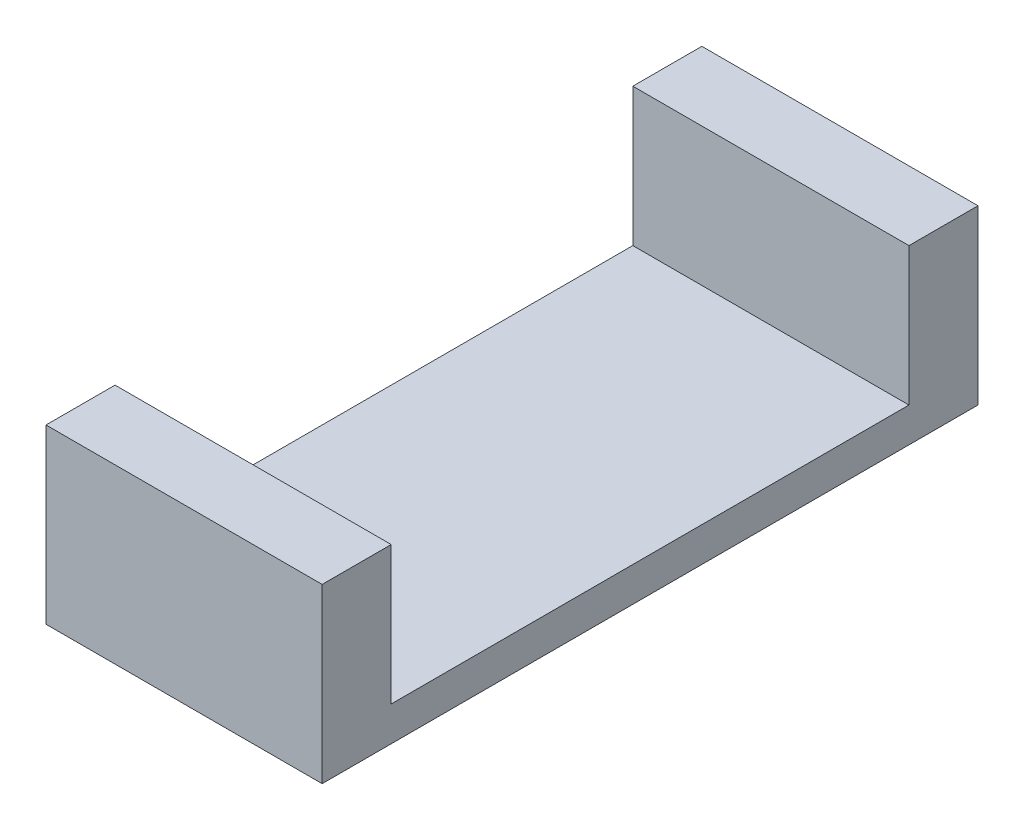
ISO-10303-21;
HEADER;
FILE_DESCRIPTION(('STEP AP214'),'2;1');
FILE_NAME('part.step','',(''),(''),'','','');
FILE_SCHEMA(('AUTOMOTIVE_DESIGN { 1 0 10303 214 1 1 1 1 }'));
ENDSEC;
DATA;
#1=APPLICATION_CONTEXT('core data for automotive mechanical design processes');
#2=APPLICATION_PROTOCOL_DEFINITION('international standard','automotive_design',2000,#1);
#3=PRODUCT_CONTEXT('',#1,'mechanical');
#4=PRODUCT('Part','Part','',(#3));
#5=PRODUCT_RELATED_PRODUCT_CATEGORY('part','',(#4));
#6=PRODUCT_DEFINITION_FORMATION('','',#4);
#7=PRODUCT_DEFINITION_CONTEXT('part definition',#1,'design');
#8=PRODUCT_DEFINITION('design','',#6,#7);
#9=PRODUCT_DEFINITION_SHAPE('','',#8);
#10=(LENGTH_UNIT() NAMED_UNIT(*) SI_UNIT(.MILLI.,.METRE.));
#11=(NAMED_UNIT(*) PLANE_ANGLE_UNIT() SI_UNIT($,.RADIAN.));
#12=(NAMED_UNIT(*) SI_UNIT($,.STERADIAN.) SOLID_ANGLE_UNIT());
#13=UNCERTAINTY_MEASURE_WITH_UNIT(LENGTH_MEASURE(1.E-05),#10,'distance_accuracy_value','');
#14=(GEOMETRIC_REPRESENTATION_CONTEXT(3) GLOBAL_UNCERTAINTY_ASSIGNED_CONTEXT((#13)) GLOBAL_UNIT_ASSIGNED_CONTEXT((#10,
#11,#12)) REPRESENTATION_CONTEXT('',''));
#15=CARTESIAN_POINT('',(0.,0.,0.));
#16=DIRECTION('',(0.,0.,1.));
#17=DIRECTION('',(1.,0.,0.));
#18=AXIS2_PLACEMENT_3D('',#15,#16,#17);
#19=CARTESIAN_POINT('',(18.5,2.02,14.33));
#20=DIRECTION('',(0.,0.,-1.));
#21=DIRECTION('',(-1.,0.,0.));
#22=AXIS2_PLACEMENT_3D('',#19,#20,#21);
#23=PLANE('',#22);
#24=DIRECTION('',(0.,1.,0.));
#25=VECTOR('',#24,1.);
#26=CARTESIAN_POINT('',(18.5,1.52,14.33));
#27=LINE('',#26,#25);
#28=CARTESIAN_POINT('',(18.5,1.62,14.33));
#29=VERTEX_POINT('',#28);
#30=CARTESIAN_POINT('',(18.5,2.02,14.33));
#31=VERTEX_POINT('',#30);
#32=EDGE_CURVE('E97',#29,#31,#27,.T.);
#33=ORIENTED_EDGE('',*,*,#32,.F.);
#34=DIRECTION('',(1.,0.,0.));
#35=VECTOR('',#34,1.);
#36=CARTESIAN_POINT('',(18.9,1.62,14.33));
#37=LINE('',#36,#35);
#38=CARTESIAN_POINT('',(19.3,1.62,14.33));
#39=VERTEX_POINT('',#38);
#40=EDGE_CURVE('E96',#29,#39,#37,.T.);
#41=ORIENTED_EDGE('',*,*,#40,.T.);
#42=DIRECTION('',(0.,1.,0.));
#43=VECTOR('',#42,1.);
#44=CARTESIAN_POINT('',(19.3,1.52,14.33));
#45=LINE('',#44,#43);
#46=CARTESIAN_POINT('',(19.3,2.02,14.33));
#47=VERTEX_POINT('',#46);
#48=EDGE_CURVE('E84',#47,#39,#45,.F.);
#49=ORIENTED_EDGE('',*,*,#48,.F.);
#50=DIRECTION('',(1.,0.,0.));
#51=VECTOR('',#50,1.);
#52=CARTESIAN_POINT('',(18.9,2.02,14.33));
#53=LINE('',#52,#51);
#54=EDGE_CURVE('E20',#31,#47,#53,.T.);
#55=ORIENTED_EDGE('',*,*,#54,.F.);
#56=EDGE_LOOP('',(#33,#41,#49,#55));
#57=FACE_BOUND('',#56,.T.);
#58=ADVANCED_FACE('F17',(#57),#23,.F.);
#59=CARTESIAN_POINT('',(18.9,2.02,15.08));
#60=DIRECTION('',(0.,1.,0.));
#61=DIRECTION('',(0.,0.,1.));
#62=AXIS2_PLACEMENT_3D('',#59,#60,#61);
#63=PLANE('',#62);
#64=DIRECTION('',(-1.,0.,0.));
#65=VECTOR('',#64,1.);
#66=CARTESIAN_POINT('',(19.3,2.02,14.13));
#67=LINE('',#66,#65);
#68=CARTESIAN_POINT('',(18.5,2.02,14.13));
#69=VERTEX_POINT('',#68);
#70=CARTESIAN_POINT('',(19.3,2.02,14.13));
#71=VERTEX_POINT('',#70);
#72=EDGE_CURVE('E136',#69,#71,#67,.F.);
#73=ORIENTED_EDGE('',*,*,#72,.F.);
#74=DIRECTION('',(0.,0.,1.));
#75=VECTOR('',#74,1.);
#76=CARTESIAN_POINT('',(18.5,2.02,14.13));
#77=LINE('',#76,#75);
#78=EDGE_CURVE('E131',#31,#69,#77,.F.);
#79=ORIENTED_EDGE('',*,*,#78,.F.);
#80=ORIENTED_EDGE('',*,*,#54,.T.);
#81=DIRECTION('',(0.,0.,-1.));
#82=VECTOR('',#81,1.);
#83=CARTESIAN_POINT('',(19.3,2.02,16.03));
#84=LINE('',#83,#82);
#85=EDGE_CURVE('E91',#71,#47,#84,.F.);
#86=ORIENTED_EDGE('',*,*,#85,.F.);
#87=EDGE_LOOP('',(#73,#79,#80,#86));
#88=FACE_BOUND('',#87,.T.);
#89=ADVANCED_FACE('F163',(#88),#63,.T.);
#90=CARTESIAN_POINT('',(19.3,2.02,15.83));
#91=DIRECTION('',(0.,0.,1.));
#92=DIRECTION('',(1.,0.,0.));
#93=AXIS2_PLACEMENT_3D('',#90,#91,#92);
#94=PLANE('',#93);
#95=DIRECTION('',(0.,1.,0.));
#96=VECTOR('',#95,1.);
#97=CARTESIAN_POINT('',(19.3,1.52,15.83));
#98=LINE('',#97,#96);
#99=CARTESIAN_POINT('',(19.3,1.62,15.83));
#100=VERTEX_POINT('',#99);
#101=CARTESIAN_POINT('',(19.3,2.02,15.83));
#102=VERTEX_POINT('',#101);
#103=EDGE_CURVE('E105',#100,#102,#98,.T.);
#104=ORIENTED_EDGE('',*,*,#103,.F.);
#105=DIRECTION('',(1.,0.,0.));
#106=VECTOR('',#105,1.);
#107=CARTESIAN_POINT('',(18.9,1.62,15.83));
#108=LINE('',#107,#106);
#109=CARTESIAN_POINT('',(18.5,1.62,15.83));
#110=VERTEX_POINT('',#109);
#111=EDGE_CURVE('E101',#100,#110,#108,.F.);
#112=ORIENTED_EDGE('',*,*,#111,.T.);
#113=DIRECTION('',(0.,1.,0.));
#114=VECTOR('',#113,1.);
#115=CARTESIAN_POINT('',(18.5,1.52,15.83));
#116=LINE('',#115,#114);
#117=CARTESIAN_POINT('',(18.5,2.02,15.83));
#118=VERTEX_POINT('',#117);
#119=EDGE_CURVE('E115',#118,#110,#116,.F.);
#120=ORIENTED_EDGE('',*,*,#119,.F.);
#121=DIRECTION('',(1.,0.,0.));
#122=VECTOR('',#121,1.);
#123=CARTESIAN_POINT('',(18.9,2.02,15.83));
#124=LINE('',#123,#122);
#125=EDGE_CURVE('E93',#102,#118,#124,.F.);
#126=ORIENTED_EDGE('',*,*,#125,.F.);
#127=EDGE_LOOP('',(#104,#112,#120,#126));
#128=FACE_BOUND('',#127,.T.);
#129=ADVANCED_FACE('F113',(#128),#94,.F.);
#130=CARTESIAN_POINT('',(18.9,1.62,15.08));
#131=DIRECTION('',(0.,-1.,0.));
#132=DIRECTION('',(0.,0.,-1.));
#133=AXIS2_PLACEMENT_3D('',#130,#131,#132);
#134=PLANE('',#133);
#135=DIRECTION('',(0.,0.,1.));
#136=VECTOR('',#135,1.);
#137=CARTESIAN_POINT('',(18.5,1.62,14.13));
#138=LINE('',#137,#136);
#139=EDGE_CURVE('E116',#110,#29,#138,.F.);
#140=ORIENTED_EDGE('',*,*,#139,.F.);
#141=ORIENTED_EDGE('',*,*,#111,.F.);
#142=DIRECTION('',(0.,0.,-1.));
#143=VECTOR('',#142,1.);
#144=CARTESIAN_POINT('',(19.3,1.62,16.03));
#145=LINE('',#144,#143);
#146=EDGE_CURVE('E89',#39,#100,#145,.F.);
#147=ORIENTED_EDGE('',*,*,#146,.F.);
#148=ORIENTED_EDGE('',*,*,#40,.F.);
#149=EDGE_LOOP('',(#140,#141,#147,#148));
#150=FACE_BOUND('',#149,.T.);
#151=ADVANCED_FACE('F103',(#150),#134,.F.);
#152=CARTESIAN_POINT('',(18.9,2.02,15.08));
#153=DIRECTION('',(0.,1.,0.));
#154=DIRECTION('',(0.,0.,1.));
#155=AXIS2_PLACEMENT_3D('',#152,#153,#154);
#156=PLANE('',#155);
#157=DIRECTION('',(1.,0.,0.));
#158=VECTOR('',#157,1.);
#159=CARTESIAN_POINT('',(18.5,2.02,16.03));
#160=LINE('',#159,#158);
#161=CARTESIAN_POINT('',(19.3,2.02,16.03));
#162=VERTEX_POINT('',#161);
#163=CARTESIAN_POINT('',(18.5,2.02,16.03));
#164=VERTEX_POINT('',#163);
#165=EDGE_CURVE('E121',#162,#164,#160,.F.);
#166=ORIENTED_EDGE('',*,*,#165,.F.);
#167=DIRECTION('',(0.,0.,-1.));
#168=VECTOR('',#167,1.);
#169=CARTESIAN_POINT('',(19.3,2.02,16.03));
#170=LINE('',#169,#168);
#171=EDGE_CURVE('E107',#102,#162,#170,.F.);
#172=ORIENTED_EDGE('',*,*,#171,.F.);
#173=ORIENTED_EDGE('',*,*,#125,.T.);
#174=DIRECTION('',(0.,0.,1.));
#175=VECTOR('',#174,1.);
#176=CARTESIAN_POINT('',(18.5,2.02,14.13));
#177=LINE('',#176,#175);
#178=EDGE_CURVE('E123',#164,#118,#177,.F.);
#179=ORIENTED_EDGE('',*,*,#178,.F.);
#180=EDGE_LOOP('',(#166,#172,#173,#179));
#181=FACE_BOUND('',#180,.T.);
#182=ADVANCED_FACE('F145',(#181),#156,.T.);
#183=CARTESIAN_POINT('',(19.3,1.52,16.03));
#184=DIRECTION('',(1.,0.,0.));
#185=DIRECTION('',(0.,0.,-1.));
#186=AXIS2_PLACEMENT_3D('',#183,#184,#185);
#187=PLANE('',#186);
#188=DIRECTION('',(0.,1.,0.));
#189=VECTOR('',#188,1.);
#190=CARTESIAN_POINT('',(19.3,1.52,14.13));
#191=LINE('',#190,#189);
#192=CARTESIAN_POINT('',(19.3,1.52,14.13));
#193=VERTEX_POINT('',#192);
#194=EDGE_CURVE('E134',#71,#193,#191,.F.);
#195=ORIENTED_EDGE('',*,*,#194,.F.);
#196=ORIENTED_EDGE('',*,*,#85,.T.);
#197=ORIENTED_EDGE('',*,*,#48,.T.);
#198=ORIENTED_EDGE('',*,*,#146,.T.);
#199=ORIENTED_EDGE('',*,*,#103,.T.);
#200=ORIENTED_EDGE('',*,*,#171,.T.);
#201=DIRECTION('',(0.,1.,0.));
#202=VECTOR('',#201,1.);
#203=CARTESIAN_POINT('',(19.3,1.52,16.03));
#204=LINE('',#203,#202);
#205=CARTESIAN_POINT('',(19.3,1.52,16.03));
#206=VERTEX_POINT('',#205);
#207=EDGE_CURVE('E118',#206,#162,#204,.T.);
#208=ORIENTED_EDGE('',*,*,#207,.F.);
#209=DIRECTION('',(0.,0.,1.));
#210=VECTOR('',#209,1.);
#211=CARTESIAN_POINT('',(19.3,1.52,15.08));
#212=LINE('',#211,#210);
#213=EDGE_CURVE('E146',#206,#193,#212,.F.);
#214=ORIENTED_EDGE('',*,*,#213,.T.);
#215=EDGE_LOOP('',(#195,#196,#197,#198,#199,#200,#208,#214));
#216=FACE_BOUND('',#215,.T.);
#217=ADVANCED_FACE('F87',(#216),#187,.T.);
#218=CARTESIAN_POINT('',(19.3,1.52,14.13));
#219=DIRECTION('',(0.,0.,-1.));
#220=DIRECTION('',(-1.,0.,0.));
#221=AXIS2_PLACEMENT_3D('',#218,#219,#220);
#222=PLANE('',#221);
#223=ORIENTED_EDGE('',*,*,#72,.T.);
#224=ORIENTED_EDGE('',*,*,#194,.T.);
#225=DIRECTION('',(1.,0.,0.));
#226=VECTOR('',#225,1.);
#227=CARTESIAN_POINT('',(18.9,1.52,14.13));
#228=LINE('',#227,#226);
#229=CARTESIAN_POINT('',(18.5,1.52,14.13));
#230=VERTEX_POINT('',#229);
#231=EDGE_CURVE('E150',#193,#230,#228,.F.);
#232=ORIENTED_EDGE('',*,*,#231,.T.);
#233=DIRECTION('',(0.,1.,0.));
#234=VECTOR('',#233,1.);
#235=CARTESIAN_POINT('',(18.5,1.52,14.13));
#236=LINE('',#235,#234);
#237=EDGE_CURVE('E129',#69,#230,#236,.F.);
#238=ORIENTED_EDGE('',*,*,#237,.F.);
#239=EDGE_LOOP('',(#223,#224,#232,#238));
#240=FACE_BOUND('',#239,.T.);
#241=ADVANCED_FACE('F161',(#240),#222,.T.);
#242=CARTESIAN_POINT('',(18.5,1.52,14.13));
#243=DIRECTION('',(-1.,0.,0.));
#244=DIRECTION('',(0.,0.,1.));
#245=AXIS2_PLACEMENT_3D('',#242,#243,#244);
#246=PLANE('',#245);
#247=ORIENTED_EDGE('',*,*,#119,.T.);
#248=ORIENTED_EDGE('',*,*,#139,.T.);
#249=ORIENTED_EDGE('',*,*,#32,.T.);
#250=ORIENTED_EDGE('',*,*,#78,.T.);
#251=ORIENTED_EDGE('',*,*,#237,.T.);
#252=DIRECTION('',(0.,0.,1.));
#253=VECTOR('',#252,1.);
#254=CARTESIAN_POINT('',(18.5,1.52,15.08));
#255=LINE('',#254,#253);
#256=CARTESIAN_POINT('',(18.5,1.52,16.03));
#257=VERTEX_POINT('',#256);
#258=EDGE_CURVE('E26',#230,#257,#255,.T.);
#259=ORIENTED_EDGE('',*,*,#258,.T.);
#260=DIRECTION('',(0.,1.,0.));
#261=VECTOR('',#260,1.);
#262=CARTESIAN_POINT('',(18.5,1.52,16.03));
#263=LINE('',#262,#261);
#264=EDGE_CURVE('E34',#164,#257,#263,.F.);
#265=ORIENTED_EDGE('',*,*,#264,.F.);
#266=ORIENTED_EDGE('',*,*,#178,.T.);
#267=EDGE_LOOP('',(#247,#248,#249,#250,#251,#259,#265,#266));
#268=FACE_BOUND('',#267,.T.);
#269=ADVANCED_FACE('F155',(#268),#246,.T.);
#270=CARTESIAN_POINT('',(18.5,1.52,16.03));
#271=DIRECTION('',(0.,0.,1.));
#272=DIRECTION('',(1.,0.,0.));
#273=AXIS2_PLACEMENT_3D('',#270,#271,#272);
#274=PLANE('',#273);
#275=ORIENTED_EDGE('',*,*,#165,.T.);
#276=ORIENTED_EDGE('',*,*,#264,.T.);
#277=DIRECTION('',(1.,0.,0.));
#278=VECTOR('',#277,1.);
#279=CARTESIAN_POINT('',(18.9,1.52,16.03));
#280=LINE('',#279,#278);
#281=EDGE_CURVE('E11',#257,#206,#280,.T.);
#282=ORIENTED_EDGE('',*,*,#281,.T.);
#283=ORIENTED_EDGE('',*,*,#207,.T.);
#284=EDGE_LOOP('',(#275,#276,#282,#283));
#285=FACE_BOUND('',#284,.T.);
#286=ADVANCED_FACE('F143',(#285),#274,.T.);
#287=CARTESIAN_POINT('',(18.9,1.52,15.08));
#288=DIRECTION('',(0.,1.,0.));
#289=DIRECTION('',(0.,0.,1.));
#290=AXIS2_PLACEMENT_3D('',#287,#288,#289);
#291=PLANE('',#290);
#292=ORIENTED_EDGE('',*,*,#258,.F.);
#293=ORIENTED_EDGE('',*,*,#231,.F.);
#294=ORIENTED_EDGE('',*,*,#213,.F.);
#295=ORIENTED_EDGE('',*,*,#281,.F.);
#296=EDGE_LOOP('',(#292,#293,#294,#295));
#297=FACE_BOUND('',#296,.T.);
#298=ADVANCED_FACE('F159',(#297),#291,.F.);
#299=CLOSED_SHELL('',(#58,#89,#129,#151,#182,#217,#241,#269,#286,#298));
#300=MANIFOLD_SOLID_BREP('B1',#299);
#301=ADVANCED_BREP_SHAPE_REPRESENTATION('',(#18,#300),#14);
#302=SHAPE_DEFINITION_REPRESENTATION(#9,#301);
ENDSEC;
END-ISO-10303-21;
